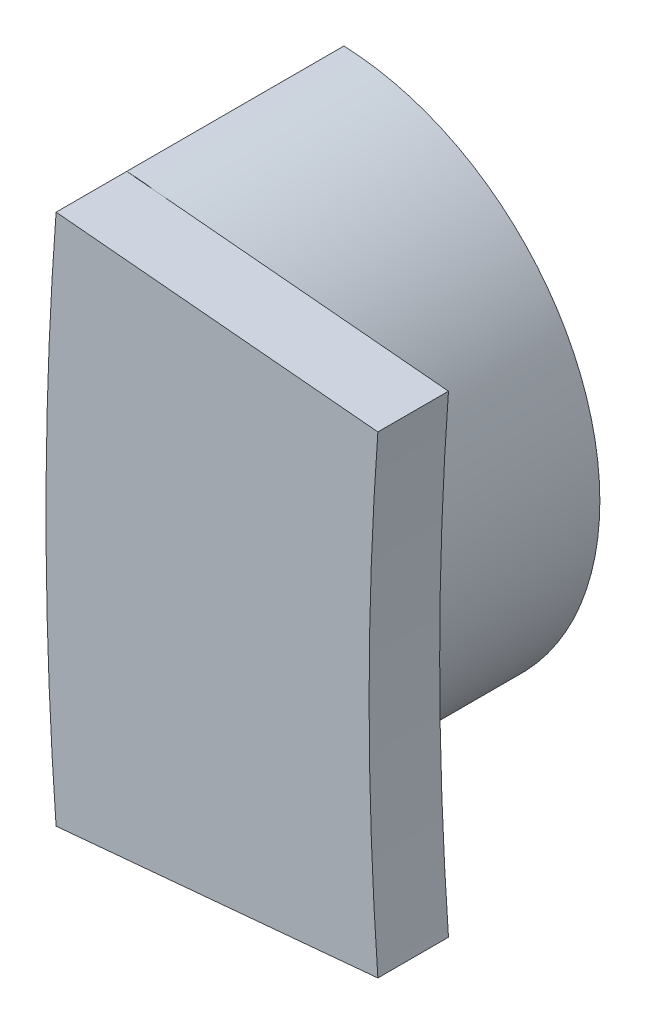
ISO-10303-21;
HEADER;
FILE_DESCRIPTION(('STEP AP214'),'2;1');
FILE_NAME('part.step','',(''),(''),'','','');
FILE_SCHEMA(('AUTOMOTIVE_DESIGN { 1 0 10303 214 1 1 1 1 }'));
ENDSEC;
DATA;
#1=APPLICATION_CONTEXT('core data for automotive mechanical design processes');
#2=APPLICATION_PROTOCOL_DEFINITION('international standard','automotive_design',2000,#1);
#3=PRODUCT_CONTEXT('',#1,'mechanical');
#4=PRODUCT('Part','Part','',(#3));
#5=PRODUCT_RELATED_PRODUCT_CATEGORY('part','',(#4));
#6=PRODUCT_DEFINITION_FORMATION('','',#4);
#7=PRODUCT_DEFINITION_CONTEXT('part definition',#1,'design');
#8=PRODUCT_DEFINITION('design','',#6,#7);
#9=PRODUCT_DEFINITION_SHAPE('','',#8);
#10=(LENGTH_UNIT() NAMED_UNIT(*) SI_UNIT(.MILLI.,.METRE.));
#11=(NAMED_UNIT(*) PLANE_ANGLE_UNIT() SI_UNIT($,.RADIAN.));
#12=(NAMED_UNIT(*) SI_UNIT($,.STERADIAN.) SOLID_ANGLE_UNIT());
#13=UNCERTAINTY_MEASURE_WITH_UNIT(LENGTH_MEASURE(1.E-05),#10,'distance_accuracy_value','');
#14=(GEOMETRIC_REPRESENTATION_CONTEXT(3) GLOBAL_UNCERTAINTY_ASSIGNED_CONTEXT((#13)) GLOBAL_UNIT_ASSIGNED_CONTEXT((#10,
#11,#12)) REPRESENTATION_CONTEXT('',''));
#15=CARTESIAN_POINT('',(0.,0.,0.));
#16=DIRECTION('',(0.,0.,1.));
#17=DIRECTION('',(1.,0.,0.));
#18=AXIS2_PLACEMENT_3D('',#15,#16,#17);
#19=CARTESIAN_POINT('',(-41.0209999996298,0.,5.08));
#20=DIRECTION('',(0.,0.,1.));
#21=DIRECTION('',(1.,0.,0.));
#22=AXIS2_PLACEMENT_3D('',#19,#20,#21);
#23=PLANE('',#22);
#24=DIRECTION('',(-0.995845881254259,0.0910548229855388,0.));
#25=VECTOR('',#24,1.);
#26=CARTESIAN_POINT('',(-81.8059883900929,6.21852293716033,5.08));
#27=LINE('',#26,#25);
#28=CARTESIAN_POINT('',(-81.1463494081902,6.15820907548541,5.08));
#29=VERTEX_POINT('',#28);
#30=CARTESIAN_POINT('',(-81.8059883900929,6.21852293716033,5.08));
#31=VERTEX_POINT('',#30);
#32=EDGE_CURVE('E56',#29,#31,#27,.T.);
#33=ORIENTED_EDGE('',*,*,#32,.F.);
#34=CARTESIAN_POINT('',(-82.042,0.,5.08));
#35=DIRECTION('',(0.,0.,1.));
#36=DIRECTION('',(-1.,0.,0.));
#37=AXIS2_PLACEMENT_3D('',#34,#35,#36);
#38=CIRCLE('',#37,6.22300000000001);
#39=EDGE_CURVE('E116',#29,#31,#38,.T.);
#40=ORIENTED_EDGE('',*,*,#39,.T.);
#41=EDGE_LOOP('',(#33,#40));
#42=FACE_BOUND('',#41,.T.);
#43=ADVANCED_FACE('F33',(#42),#23,.T.);
#44=CARTESIAN_POINT('',(7.40338346183478E-10,0.,5.08));
#45=DIRECTION('',(0.,0.,-1.));
#46=DIRECTION('',(-1.,0.,0.));
#47=AXIS2_PLACEMENT_3D('',#44,#45,#46);
#48=CYLINDRICAL_SURFACE('',#47,82.0420000007382);
#49=CARTESIAN_POINT('',(-82.0419999999979,0.,2.64922));
#50=CARTESIAN_POINT('',(-82.0420000184703,0.017666016010651,2.64921934162447));
#51=CARTESIAN_POINT('',(-82.0419942944228,0.0353339994536826,2.64960660786292));
#52=CARTESIAN_POINT('',(-82.0419716754719,0.0703433347638617,2.65118185721522));
#53=CARTESIAN_POINT('',(-82.041954965437,0.0876852885811285,2.65235659532712));
#54=CARTESIAN_POINT('',(-82.0419109996636,0.122043114910474,2.65550635207967));
#55=CARTESIAN_POINT('',(-82.041883900638,0.139060064847319,2.65746949797516));
#56=CARTESIAN_POINT('',(-82.0418197992292,0.172767096852397,2.66219438330502));
#57=CARTESIAN_POINT('',(-82.0417829243558,0.189458610641181,2.66494587495448));
#58=CARTESIAN_POINT('',(-82.0416998951203,0.222514516863662,2.67124579081534));
#59=CARTESIAN_POINT('',(-82.0416538392637,0.238880509325821,2.67478579850643));
#60=CARTESIAN_POINT('',(-82.041553061846,0.27128521115976,2.68266081513089));
#61=CARTESIAN_POINT('',(-82.0414984106798,0.287325477634632,2.68698940765725));
#62=CARTESIAN_POINT('',(-82.0413810430945,0.319078813043122,2.69643952573307));
#63=CARTESIAN_POINT('',(-82.0413183707385,0.334793161581902,2.70155674828186));
#64=CARTESIAN_POINT('',(-82.04118554765,0.365894980386381,2.71258195819879));
#65=CARTESIAN_POINT('',(-82.0411154172616,0.381283209211439,2.71848780507907));
#66=CARTESIAN_POINT('',(-82.0409682504134,0.41173335601415,2.73108806979321));
#67=CARTESIAN_POINT('',(-82.0408912139409,0.426795273386686,2.73778248908928));
#68=CARTESIAN_POINT('',(-82.0407307919902,0.456593600799065,2.75195774938994));
#69=CARTESIAN_POINT('',(-82.0406473900984,0.471329033619345,2.75944064378513));
#70=CARTESIAN_POINT('',(-82.0404747785809,0.500475407467583,2.77519082010412));
#71=CARTESIAN_POINT('',(-82.0403855404854,0.51488421170194,2.78346205358743));
#72=CARTESIAN_POINT('',(-82.0402017817508,0.543378516255494,2.8007870499236));
#73=CARTESIAN_POINT('',(-82.0401072250853,0.55746058258278,2.80984645561173));
#74=CARTESIAN_POINT('',(-82.0399133381632,0.585302727709975,2.82874616731836));
#75=CARTESIAN_POINT('',(-82.0398139687412,0.59905798979236,2.83859356159248));
#76=CARTESIAN_POINT('',(-82.0396109495037,0.626247901107876,2.8590678714826));
#77=CARTESIAN_POINT('',(-82.0395072615111,0.639676319325833,2.86970305167153));
#78=CARTESIAN_POINT('',(-82.0392960817323,0.666213984501214,2.89175187222689));
#79=CARTESIAN_POINT('',(-82.039188556404,0.67931560721216,2.90317467778279));
#80=CARTESIAN_POINT('',(-82.0389701670818,0.705200899590948,2.92679781642838));
#81=CARTESIAN_POINT('',(-82.0388592773168,0.717975614933986,2.93900794359062));
#82=CARTESIAN_POINT('',(-82.0386365575508,0.742988641089158,2.9639856324596));
#83=CARTESIAN_POINT('',(-82.0385247268603,0.755226508522254,2.97675363816931));
#84=CARTESIAN_POINT('',(-82.0383033103829,0.778904278573242,3.0026268602913));
#85=CARTESIAN_POINT('',(-82.0381937179144,0.790353992060458,3.01572308229566));
#86=CARTESIAN_POINT('',(-82.0379777908823,0.812455741127486,3.04225133707883));
#87=CARTESIAN_POINT('',(-82.037871432117,0.823116960312706,3.05567570926292));
#88=CARTESIAN_POINT('',(-82.0376629079712,0.843642479227437,3.08285890200632));
#89=CARTESIAN_POINT('',(-82.0375607068293,0.853515061765278,3.09661146064525));
#90=CARTESIAN_POINT('',(-82.0373613601932,0.872464285830176,3.12444956987893));
#91=CARTESIAN_POINT('',(-82.0372641736946,0.881548032782525,3.13853027870928));
#92=CARTESIAN_POINT('',(-82.0370756437653,0.898920857060205,3.16702323256388));
#93=CARTESIAN_POINT('',(-82.0369842605921,0.907215592112899,3.1814320248327));
#94=CARTESIAN_POINT('',(-82.0368080501555,0.923011926497248,3.2105797335644));
#95=CARTESIAN_POINT('',(-82.0367231907728,0.93051748884223,3.22531650083216));
#96=CARTESIAN_POINT('',(-82.0365606663543,0.944737250519795,3.25511885064117));
#97=CARTESIAN_POINT('',(-82.0364829827064,0.951453510180065,3.27018344970331));
#98=CARTESIAN_POINT('',(-82.0363353744196,0.964096632250191,3.30064030914226));
#99=CARTESIAN_POINT('',(-82.0362654497512,0.970023497652457,3.31603256827674));
#100=CARTESIAN_POINT('',(-82.0361338512348,0.98108993235574,3.34714379329947));
#101=CARTESIAN_POINT('',(-82.0360721999219,0.986227356665532,3.3628635219615));
#102=CARTESIAN_POINT('',(-82.0359575682751,0.995717078284553,3.39462896312444));
#103=CARTESIAN_POINT('',(-82.035904635722,1.0000650617496,3.41067596335777));
#104=CARTESIAN_POINT('',(-82.0358077914701,1.00797806737864,3.44309547180042));
#105=CARTESIAN_POINT('',(-82.0357639540717,1.01153665593779,3.45946954806141));
#106=CARTESIAN_POINT('',(-82.0356855811586,1.01787296464649,3.49254298631075));
#107=CARTESIAN_POINT('',(-82.0356511463322,1.02064224521564,3.50924396133933));
#108=CARTESIAN_POINT('',(-82.0355917921405,1.02540189510842,3.54297119362428));
#109=CARTESIAN_POINT('',(-82.0355669984178,1.02738198752727,3.55999889539073));
#110=CARTESIAN_POINT('',(-82.0355270738102,1.03056503345604,3.59437985031052));
#111=CARTESIAN_POINT('',(-82.035512090971,1.03175608336157,3.61173419863703));
#112=CARTESIAN_POINT('',(-82.0354918703505,1.03336258697337,3.64676864922359));
#113=CARTESIAN_POINT('',(-82.0354867995856,1.033764748471,3.66444934925843));
#114=CARTESIAN_POINT('',(-82.0354864243432,1.03379452552585,3.69981797311467));
#115=CARTESIAN_POINT('',(-82.0354911234957,1.03342185319836,3.7175058971789));
#116=CARTESIAN_POINT('',(-82.0355106166977,1.03187327534074,3.75255581202836));
#117=CARTESIAN_POINT('',(-82.0355252434598,1.03071068022822,3.76991837915391));
#118=CARTESIAN_POINT('',(-82.0355644744538,1.02758346186429,3.80431678569158));
#119=CARTESIAN_POINT('',(-82.0355889303422,1.02563076025212,3.82135370200951));
#120=CARTESIAN_POINT('',(-82.0356476294592,1.02092481855931,3.85510037386146));
#121=CARTESIAN_POINT('',(-82.0356817467497,1.01818187196035,3.87181155901399));
#122=CARTESIAN_POINT('',(-82.0357595071579,1.01189715734677,3.90490642453466));
#123=CARTESIAN_POINT('',(-82.0358030493146,1.00836384343024,3.92129170648481));
#124=CARTESIAN_POINT('',(-82.0358993273847,1.0005003161058,3.95373462978883));
#125=CARTESIAN_POINT('',(-82.0359519887693,0.996176548018359,3.96979383108296));
#126=CARTESIAN_POINT('',(-82.036066103921,0.986734189068285,4.00158467446044));
#127=CARTESIAN_POINT('',(-82.0361275097416,0.981619920327398,4.01731759927534));
#128=CARTESIAN_POINT('',(-82.0362586444527,0.970598732357865,4.04845621358206));
#129=CARTESIAN_POINT('',(-82.0363283507201,0.964693962437664,4.0638626635871));
#130=CARTESIAN_POINT('',(-82.0364755505259,0.952093971040911,4.0943488990513));
#131=CARTESIAN_POINT('',(-82.0365530440937,0.945398746569478,4.10942868327254));
#132=CARTESIAN_POINT('',(-82.036715217623,0.931219999384277,4.13926239548158));
#133=CARTESIAN_POINT('',(-82.0367999162899,0.923734411848001,4.15401534171916));
#134=CARTESIAN_POINT('',(-82.0369758353295,0.907976975767756,4.18319639890949));
#135=CARTESIAN_POINT('',(-82.0370670880078,0.899701155244563,4.19762236356008));
#136=CARTESIAN_POINT('',(-82.0372553875666,0.882365112940117,4.22615065143134));
#137=CARTESIAN_POINT('',(-82.0373524744642,0.873299220195117,4.24024952541397));
#138=CARTESIAN_POINT('',(-82.0375516529181,0.854384662373689,4.26812495451944));
#139=CARTESIAN_POINT('',(-82.0376537858322,0.844528874729288,4.28189667155086));
#140=CARTESIAN_POINT('',(-82.037862204802,0.824035904318494,4.30911916748012));
#141=CARTESIAN_POINT('',(-82.0379685270392,0.813390418121904,4.3225636878453));
#142=CARTESIAN_POINT('',(-82.0381844122654,0.791319107873725,4.34913323760672));
#143=CARTESIAN_POINT('',(-82.0382939999265,0.779884076846419,4.36225060942161));
#144=CARTESIAN_POINT('',(-82.0385154382997,0.756234605716559,4.38816708506172));
#145=CARTESIAN_POINT('',(-82.0386272962057,0.744010328360298,4.40095719600206));
#146=CARTESIAN_POINT('',(-82.0388502763936,0.719003482995452,4.42599966224629));
#147=CARTESIAN_POINT('',(-82.0389613980252,0.70622048194356,4.43825158513133));
#148=CARTESIAN_POINT('',(-82.039180261406,0.680316800292215,4.4619556001036));
#149=CARTESIAN_POINT('',(-82.0392880286785,0.667205149810224,4.47341754246227));
#150=CARTESIAN_POINT('',(-82.039499700022,0.640645574370166,4.49554187613283));
#151=CARTESIAN_POINT('',(-82.0396036375106,0.627205340577731,4.5062134890445));
#152=CARTESIAN_POINT('',(-82.0398071601547,0.599989965588686,4.52675791657384));
#153=CARTESIAN_POINT('',(-82.0399067834753,0.58622111122845,4.53663904909329));
#154=CARTESIAN_POINT('',(-82.0401011793725,0.558349957510586,4.55560349010578));
#155=CARTESIAN_POINT('',(-82.040195991186,0.544252518899619,4.56469393462435));
#156=CARTESIAN_POINT('',(-82.0403802580276,0.515725658951389,4.58207826863155));
#157=CARTESIAN_POINT('',(-82.0404697492017,0.501299703478465,4.59037784035465));
#158=CARTESIAN_POINT('',(-82.0406428612419,0.472117228658336,4.60618196213785));
#159=CARTESIAN_POINT('',(-82.0407265107032,0.457362866161415,4.61369049214642));
#160=CARTESIAN_POINT('',(-82.0408874186278,0.427524892973392,4.62791430449189));
#161=CARTESIAN_POINT('',(-82.0409646935905,0.412442268735288,4.63463165529156));
#162=CARTESIAN_POINT('',(-82.0411123246442,0.381948932568304,4.64727507776812));
#163=CARTESIAN_POINT('',(-82.041182680748,0.366538221247927,4.65320115091245));
#164=CARTESIAN_POINT('',(-82.041315938802,0.335389670823069,4.66426412362004));
#165=CARTESIAN_POINT('',(-82.0413788202791,0.319651065989609,4.66939886660013));
#166=CARTESIAN_POINT('',(-82.0414965858669,0.28784745814609,4.67888135208309));
#167=CARTESIAN_POINT('',(-82.0415514256185,0.271781163523296,4.6832247591614));
#168=CARTESIAN_POINT('',(-82.041652556102,0.239322649824505,4.69112674768546));
#169=CARTESIAN_POINT('',(-82.0416987759472,0.222928859202399,4.69467886455139));
#170=CARTESIAN_POINT('',(-82.0417821050856,0.189815603130675,4.70100035691184));
#171=CARTESIAN_POINT('',(-82.0418191151658,0.173094523046731,4.70376125326788));
#172=CARTESIAN_POINT('',(-82.0418834548474,0.139326603878404,4.70850232018005));
#173=CARTESIAN_POINT('',(-82.0419106560063,0.122278320261304,4.71047216777404));
#174=CARTESIAN_POINT('',(-82.0419547896677,0.087856072224001,4.71363271128817));
#175=CARTESIAN_POINT('',(-82.041971564298,0.0704810209836749,4.71481144897177));
#176=CARTESIAN_POINT('',(-82.0419942718882,0.0354037230491259,4.71639209267559));
#177=CARTESIAN_POINT('',(-82.0420000186052,0.0177008692472679,4.71678066045052));
#178=CARTESIAN_POINT('',(-82.0419999999979,0.,4.71678));
#179=B_SPLINE_CURVE_WITH_KNOTS('',3,(#49,#50,#51,#52,#53,#54,#55,#56,#57,#58,#59,#60,#61,#62,
#63,#64,#65,#66,#67,#68,#69,#70,#71,#72,#73,#74,#75,#76,#77,#78,#79,#80,#81,#82,#83,#84,#85,#86,
#87,#88,#89,#90,#91,#92,#93,#94,#95,#96,#97,#98,#99,#100,#101,#102,#103,#104,#105,#106,#107,
#108,#109,#110,#111,#112,#113,#114,#115,#116,#117,#118,#119,#120,#121,#122,#123,#124,#125,#126,
#127,#128,#129,#130,#131,#132,#133,#134,#135,#136,#137,#138,#139,#140,#141,#142,#143,#144,#145,
#146,#147,#148,#149,#150,#151,#152,#153,#154,#155,#156,#157,#158,#159,#160,#161,#162,#163,#164,
#165,#166,#167,#168,#169,#170,#171,#172,#173,#174,#175,#176,#177,#178),.UNSPECIFIED.,.F.,.F.,(4,
2,2,2,2,2,2,2,2,2,2,2,2,2,2,2,2,2,2,2,2,2,2,2,2,2,2,2,2,2,2,2,2,2,2,2,2,2,2,2,2,2,2,2,2,2,2,2,2,
2,2,2,2,2,2,2,2,2,2,2,2,2,2,2,4),(0.,0.0529966492727824,0.105123561515776,0.15649327854614,
0.20722338181362,0.257435946269652,0.307256851349344,0.356814961065796,0.406241194954181,
0.455667520491657,0.505225904423363,0.555047264117367,0.605260460068822,0.655991366976093,
0.707362054003771,0.759490095956781,0.812488027351534,0.865528935575138,0.917697864642035,
0.969107586984047,1.01987593459555,1.07012525164429,1.11998170343727,1.16957445375284,
1.21903473235488,1.26849482345928,1.31808701278308,1.36794253453418,1.41819055970486,
1.46895726331467,1.52036500139636,1.57253161956724,1.62556990522541,1.67862790045132,
1.73081332683325,1.78223908032133,1.83302312351237,1.88328793714653,1.9331598276493,
1.98276810277265,2.03224413722168,2.08172035913199,2.13132919513718,2.18120201549589,
2.23146812074239,2.28225380758472,2.33368154489257,2.38586928163413,2.43892989878771,
2.49203239670137,2.54426022600336,2.59572649678448,2.64654940410207,2.69685167834367,
2.74675989094538,2.79640362752777,2.84591455040502,2.89542538146219,2.94506884332065,
2.99497660047428,3.04527824208167,3.09610034434197,3.14756564346057,3.19979234117366,
3.25289355490823),.UNSPECIFIED.);
#180=CARTESIAN_POINT('',(-82.0419999999979,0.,2.64922));
#181=VERTEX_POINT('',#180);
#182=CARTESIAN_POINT('',(-82.0419999999979,0.,4.71678));
#183=VERTEX_POINT('',#182);
#184=EDGE_CURVE('E44',#181,#183,#179,.T.);
#185=ORIENTED_EDGE('',*,*,#184,.T.);
#186=CARTESIAN_POINT('',(-82.0419999999979,0.,4.71678));
#187=CARTESIAN_POINT('',(-82.0420000185544,-0.0176877709544173,4.71678065967281));
#188=CARTESIAN_POINT('',(-82.0419942803622,-0.0353775200162267,4.71639258114873));
#189=CARTESIAN_POINT('',(-82.0419716061038,-0.0704292773555671,4.71481396528474));
#190=CARTESIAN_POINT('',(-82.041954855763,-0.0877918907988414,4.71363673109781));
#191=CARTESIAN_POINT('',(-82.0419107852303,-0.122189930260955,4.71048024253676));
#192=CARTESIAN_POINT('',(-82.0418836224741,-0.139226439562171,4.70851291422193));
#193=CARTESIAN_POINT('',(-82.0418193723818,-0.172971479775946,4.70377793028092));
#194=CARTESIAN_POINT('',(-82.041782413137,-0.189681450396415,4.70102056931983));
#195=CARTESIAN_POINT('',(-82.0416991967532,-0.222773158176852,4.69470718798595));
#196=CARTESIAN_POINT('',(-82.0416530385608,-0.239156504470427,4.6911596231807));
#197=CARTESIAN_POINT('',(-82.0415520408104,-0.271594800793636,4.68326777392033));
#198=CARTESIAN_POINT('',(-82.041497271954,-0.287651316929632,4.67892993591105));
#199=CARTESIAN_POINT('',(-82.0413796559817,-0.319436038857523,4.66945961796942));
#200=CARTESIAN_POINT('',(-82.0413168531136,-0.33516553173946,4.66433146125594));
#201=CARTESIAN_POINT('',(-82.0411837585565,-0.366296528230702,4.65328268432096));
#202=CARTESIAN_POINT('',(-82.0411134872922,-0.381698794868441,4.64736421462374));
#203=CARTESIAN_POINT('',(-82.0409660307106,-0.412175909625204,4.63473701599449));
#204=CARTESIAN_POINT('',(-82.0408888453805,-0.427250757136998,4.62802828559699));
#205=CARTESIAN_POINT('',(-82.0407281200911,-0.457073841945648,4.61382272491884));
#206=CARTESIAN_POINT('',(-82.0406445636648,-0.471821096267427,4.60632383184869));
#207=CARTESIAN_POINT('',(-82.0404716397067,-0.500990016175987,4.59053998920845));
#208=CARTESIAN_POINT('',(-82.0403822436268,-0.515409532466795,4.58225107037472));
#209=CARTESIAN_POINT('',(-82.0401981676926,-0.543924171339907,4.56488904260099));
#210=CARTESIAN_POINT('',(-82.0401034517372,-0.558015840062844,4.55581026625453));
#211=CARTESIAN_POINT('',(-82.0399092470483,-0.585876106711106,4.53687015807942));
#212=CARTESIAN_POINT('',(-82.0398097191047,-0.599639860468411,4.52700170819752));
#213=CARTESIAN_POINT('',(-82.0396063855382,-0.626845682791321,4.50648363989257));
#214=CARTESIAN_POINT('',(-82.0395025417453,-0.640281485557038,4.49582572364576));
#215=CARTESIAN_POINT('',(-82.0392910550264,-0.666832841716772,4.47372977437429));
#216=CARTESIAN_POINT('',(-82.0391833786363,-0.679940729075861,4.46228254090688));
#217=CARTESIAN_POINT('',(-82.0389646931515,-0.705837528698881,4.43860893823874));
#218=CARTESIAN_POINT('',(-82.0388536584373,-0.718617439674236,4.42637274017256));
#219=CARTESIAN_POINT('',(-82.0386308636772,-0.743616773595364,4.40136439747226));
#220=CARTESIAN_POINT('',(-82.0385191044418,-0.755836729619645,4.3885927857133));
#221=CARTESIAN_POINT('',(-82.0382978469217,-0.779479245518505,4.36271321879255));
#222=CARTESIAN_POINT('',(-82.0381883416493,-0.790911605355295,4.34961423253147));
#223=CARTESIAN_POINT('',(-82.0379726022886,-0.812979264921471,4.32308136538338));
#224=CARTESIAN_POINT('',(-82.037866343788,-0.823623736076015,4.30965512176259));
#225=CARTESIAN_POINT('',(-82.0376580313352,-0.844116364495442,4.2824690856098));
#226=CARTESIAN_POINT('',(-82.0375559414868,-0.853972792702111,4.26871553535732));
#227=CARTESIAN_POINT('',(-82.03735682646,-0.872890316638741,4.24087634214875));
#228=CARTESIAN_POINT('',(-82.037259760206,-0.881958506764832,4.22679552516031));
#229=CARTESIAN_POINT('',(-82.0370714778023,-0.899300823963249,4.19830324922913));
#230=CARTESIAN_POINT('',(-82.0369802218848,-0.907580599408517,4.18389523136082));
#231=CARTESIAN_POINT('',(-82.0368042711215,-0.923347619481525,4.15474996165272));
#232=CARTESIAN_POINT('',(-82.0367195441585,-0.930838820215782,4.14001485145951));
#233=CARTESIAN_POINT('',(-82.0365572879915,-0.945030460839877,4.11021670173098));
#234=CARTESIAN_POINT('',(-82.0364797401856,-0.951732957312263,4.09515464208377));
#235=CARTESIAN_POINT('',(-82.0363324053666,-0.964349151833262,4.06470374344241));
#236=CARTESIAN_POINT('',(-82.0362626183242,-0.970262852869758,4.0493149056863));
#237=CARTESIAN_POINT('',(-82.0361312953364,-0.981303553766173,4.01821140184182));
#238=CARTESIAN_POINT('',(-82.0360697819002,-0.986428412766611,4.00249597603062));
#239=CARTESIAN_POINT('',(-82.0359554248939,-0.99589359449584,3.9707400160417));
#240=CARTESIAN_POINT('',(-82.0359026290396,-1.00022961182903,3.95469819959445));
#241=CARTESIAN_POINT('',(-82.0358060557989,-1.00811927149601,3.92228993193658));
#242=CARTESIAN_POINT('',(-82.0357623526003,-1.01166649294678,3.90592191985261));
#243=CARTESIAN_POINT('',(-82.035684244531,-1.01798064988782,3.87286148162596));
#244=CARTESIAN_POINT('',(-82.035649940184,-1.02073916254678,3.85616745064598));
#245=CARTESIAN_POINT('',(-82.0355908423539,-1.02547785379293,3.8224549773122));
#246=CARTESIAN_POINT('',(-82.035566174296,-1.02744777580916,3.80543509904206));
#247=CARTESIAN_POINT('',(-82.0355264953994,-1.03061105990794,3.77107066166361));
#248=CARTESIAN_POINT('',(-82.0355116323379,-1.03179254185007,3.75372501582655));
#249=CARTESIAN_POINT('',(-82.0354916450461,-1.03338046571286,3.71870884141501));
#250=CARTESIAN_POINT('',(-82.0354866875235,-1.03377364100032,3.70103772294037));
#251=CARTESIAN_POINT('',(-82.0354865288224,-1.03378623473488,3.66567936234238));
#252=CARTESIAN_POINT('',(-82.0354913363962,-1.03340495906154,3.64799211996934));
#253=CARTESIAN_POINT('',(-82.0355110429962,-1.03183938965724,3.61294393477151));
#254=CARTESIAN_POINT('',(-82.035525774771,-1.03066840445712,3.59558240918699));
#255=CARTESIAN_POINT('',(-82.0355652118887,-1.02752460065345,3.56118645050002));
#256=CARTESIAN_POINT('',(-82.0355897689305,-1.02556370199932,3.54415093482597));
#257=CARTESIAN_POINT('',(-82.0356486657103,-1.02084156643903,3.51040742845992));
#258=CARTESIAN_POINT('',(-82.0356828795592,-1.01809062122534,3.49369800332151));
#259=CARTESIAN_POINT('',(-82.0357608278212,-1.01179010818201,3.4606070210865));
#260=CARTESIAN_POINT('',(-82.0358044613226,-1.00824899277471,3.44422385850213));
#261=CARTESIAN_POINT('',(-82.0359009162179,-1.00037006150603,3.41178553624276));
#262=CARTESIAN_POINT('',(-82.0359536631274,-0.996038689513343,3.39572881369721));
#263=CARTESIAN_POINT('',(-82.0360679429087,-0.986581321427845,3.36394328912088));
#264=CARTESIAN_POINT('',(-82.0361294278682,-0.981459646366651,3.34821320242701));
#265=CARTESIAN_POINT('',(-82.0362607139187,-0.970423844060393,3.31708062464866));
#266=CARTESIAN_POINT('',(-82.0363304924059,-0.96451186552202,3.30167737210779));
#267=CARTESIAN_POINT('',(-82.036477829234,-0.951897654663458,3.27119789086289));
#268=CARTESIAN_POINT('',(-82.0365553876043,-0.945195419348461,3.25612166339844));
#269=CARTESIAN_POINT('',(-82.0367176828806,-0.931002847629621,3.22629542304657));
#270=CARTESIAN_POINT('',(-82.0368024384693,-0.923510447096811,3.21154639278223));
#271=CARTESIAN_POINT('',(-82.0369784630909,-0.907739581444222,3.18237352504741));
#272=CARTESIAN_POINT('',(-82.0370697643821,-0.899457145796576,3.16795183552508));
#273=CARTESIAN_POINT('',(-82.0372581525365,-0.88210806897595,3.13943245458543));
#274=CARTESIAN_POINT('',(-82.0373552793437,-0.873035759083356,3.12533821470889));
#275=CARTESIAN_POINT('',(-82.0375545286561,-0.85410856161488,3.09747241018277));
#276=CARTESIAN_POINT('',(-82.0376566924206,-0.844246554508294,3.08370568646263));
#277=CARTESIAN_POINT('',(-82.037865163821,-0.823741340155583,3.05649353181698));
#278=CARTESIAN_POINT('',(-82.0379715075153,-0.813089833301781,3.04305436265239));
#279=CARTESIAN_POINT('',(-82.0381874261563,-0.791006671720365,3.01649587418326));
#280=CARTESIAN_POINT('',(-82.03829702563,-0.779565814501617,3.003384216037));
#281=CARTESIAN_POINT('',(-82.0385184777513,-0.755904896497278,2.97747950883608));
#282=CARTESIAN_POINT('',(-82.0386303374257,-0.743675003864079,2.96469545612583));
#283=CARTESIAN_POINT('',(-82.0388532425262,-0.718664925610221,2.939673166174));
#284=CARTESIAN_POINT('',(-82.0389642878124,-0.70588464789745,2.92743502097821));
#285=CARTESIAN_POINT('',(-82.0391829951019,-0.679987010508945,2.90375766827541));
#286=CARTESIAN_POINT('',(-82.0392906827103,-0.666878655957029,2.89230862900049));
#287=CARTESIAN_POINT('',(-82.039502192174,-0.640326284896322,2.87020919087952));
#288=CARTESIAN_POINT('',(-82.0396060474885,-0.626889937443212,2.8595495890518));
#289=CARTESIAN_POINT('',(-82.0398094043155,-0.599682939603939,2.83902827791504));
#290=CARTESIAN_POINT('',(-82.0399089439974,-0.585918557617937,2.82915826829969));
#291=CARTESIAN_POINT('',(-82.0401031722148,-0.558056950505645,2.81021516734863));
#292=CARTESIAN_POINT('',(-82.0401978999638,-0.543964571581298,2.80113495575323));
#293=CARTESIAN_POINT('',(-82.0403819993857,-0.515448428452222,2.78377018426295));
#294=CARTESIAN_POINT('',(-82.0404714071652,-0.501028119582649,2.77547995513821));
#295=CARTESIAN_POINT('',(-82.0406443542624,-0.471857531354794,2.75969361817068));
#296=CARTESIAN_POINT('',(-82.0407279221341,-0.457109402220593,2.75219353975096));
#297=CARTESIAN_POINT('',(-82.0408886698909,-0.42728448515202,2.73798573411052));
#298=CARTESIAN_POINT('',(-82.0409658662471,-0.412208680620079,2.73127594340295));
#299=CARTESIAN_POINT('',(-82.0411133442909,-0.381729569695865,2.71864674923777));
#300=CARTESIAN_POINT('',(-82.0411836259913,-0.366326263910981,2.71272734431444));
#301=CARTESIAN_POINT('',(-82.0413167406595,-0.335193107412667,2.70167682129605));
#302=CARTESIAN_POINT('',(-82.0413795531967,-0.319462493338981,2.69654785446998));
#303=CARTESIAN_POINT('',(-82.0414971875719,-0.287675447629368,2.6870760399181));
#304=CARTESIAN_POINT('',(-82.0415519651483,-0.271617728347678,2.68273751691137));
#305=CARTESIAN_POINT('',(-82.0416529792244,-0.239176944532689,2.67484442051921));
#306=CARTESIAN_POINT('',(-82.0416991449996,-0.222792313224608,2.67129629580849));
#307=CARTESIAN_POINT('',(-82.0417823752513,-0.189697954309102,2.66498191681642));
#308=CARTESIAN_POINT('',(-82.0418193407482,-0.172986616892137,2.66222412099977));
#309=CARTESIAN_POINT('',(-82.0418836018589,-0.139238761931034,2.65748838885181));
#310=CARTESIAN_POINT('',(-82.0419107693381,-0.122200804086083,2.65552075066376));
#311=CARTESIAN_POINT('',(-82.0419548476346,-0.0877997863925629,2.65236376334246));
#312=CARTESIAN_POINT('',(-82.0419716009625,-0.0704356428268521,2.65118634422377));
#313=CARTESIAN_POINT('',(-82.0419942793201,-0.0353807434771228,2.64960747893486));
#314=CARTESIAN_POINT('',(-82.0420000185606,-0.0176893822887079,2.64921934023138));
#315=CARTESIAN_POINT('',(-82.0419999999979,0.,2.64922));
#316=B_SPLINE_CURVE_WITH_KNOTS('',3,(#186,#187,#188,#189,#190,#191,#192,#193,#194,#195,#196,
#197,#198,#199,#200,#201,#202,#203,#204,#205,#206,#207,#208,#209,#210,#211,#212,#213,#214,#215,
#216,#217,#218,#219,#220,#221,#222,#223,#224,#225,#226,#227,#228,#229,#230,#231,#232,#233,#234,
#235,#236,#237,#238,#239,#240,#241,#242,#243,#244,#245,#246,#247,#248,#249,#250,#251,#252,#253,
#254,#255,#256,#257,#258,#259,#260,#261,#262,#263,#264,#265,#266,#267,#268,#269,#270,#271,#272,
#273,#274,#275,#276,#277,#278,#279,#280,#281,#282,#283,#284,#285,#286,#287,#288,#289,#290,#291,
#292,#293,#294,#295,#296,#297,#298,#299,#300,#301,#302,#303,#304,#305,#306,#307,#308,#309,#310,
#311,#312,#313,#314,#315),.UNSPECIFIED.,.F.,.F.,(4,2,2,2,2,2,2,2,2,2,2,2,2,2,2,2,2,2,2,2,2,2,2,
2,2,2,2,2,2,2,2,2,2,2,2,2,2,2,2,2,2,2,2,2,2,2,2,2,2,2,2,2,2,2,2,2,2,2,2,2,2,2,2,2,4),(0.,
0.0530619170562973,0.105251115903248,0.156680497474213,0.207468030187763,0.25773620150333,
0.307611325498959,0.357222718522183,0.406701764791877,0.456180902817527,0.505792570374182,
0.555668149505698,0.605936953028915,0.656725290268998,0.708155642879027,0.760345972611641,
0.813409173077017,0.866420760606336,0.918561708069615,0.969944626630003,1.02068717450432,
1.07091151061194,1.12074360506835,1.17031241851267,1.21974897201952,1.26918533826007,
1.31875359140301,1.36858475695667,1.41880780275734,1.46954870861117,1.5209296452764,
1.57306828456342,1.62607725257079,1.67913375211537,1.73131775135295,1.7827421379855,
1.83352486572063,1.88378840582145,1.93365905472667,1.98326610979407,2.03274093505009,
2.08221594780513,2.13182356386745,2.18169514281634,2.2319599747909,2.28274434651077,
2.33417071736702,2.38635702743631,2.43941614944661,2.49248418423024,2.54467912722581,
2.5961138986633,2.64690648898313,2.69717941042149,2.74705900453094,2.79667461766906,
2.84615766633831,2.8956406232436,2.94525596182487,2.99513510075997,3.04540738993812,
3.09619917566591,3.14763297598756,3.19982678801067,3.25289353929033),.UNSPECIFIED.);
#317=EDGE_CURVE('E11',#183,#181,#316,.T.);
#318=ORIENTED_EDGE('',*,*,#317,.T.);
#319=EDGE_LOOP('',(#185,#318));
#320=FACE_BOUND('',#319,.T.);
#321=CARTESIAN_POINT('',(7.40338346183478E-10,0.,0.));
#322=DIRECTION('',(0.,0.,1.));
#323=DIRECTION('',(1.,0.,0.));
#324=AXIS2_PLACEMENT_3D('',#321,#322,#323);
#325=CIRCLE('',#324,82.0420000007382);
#326=CARTESIAN_POINT('',(-81.8059883900929,6.21852293716033,0.));
#327=VERTEX_POINT('',#326);
#328=CARTESIAN_POINT('',(-81.8059883900929,-6.21852293716033,0.));
#329=VERTEX_POINT('',#328);
#330=EDGE_CURVE('E117',#327,#329,#325,.T.);
#331=ORIENTED_EDGE('',*,*,#330,.T.);
#332=DIRECTION('',(0.,0.,-1.));
#333=VECTOR('',#332,1.);
#334=CARTESIAN_POINT('',(-81.8059883900929,-6.21852293716033,5.08));
#335=LINE('',#334,#333);
#336=CARTESIAN_POINT('',(-81.8059883900929,-6.21852293716033,5.08));
#337=VERTEX_POINT('',#336);
#338=EDGE_CURVE('E107',#337,#329,#335,.T.);
#339=ORIENTED_EDGE('',*,*,#338,.F.);
#340=DIRECTION('',(0.,0.,-1.));
#341=VECTOR('',#340,1.);
#342=CARTESIAN_POINT('',(-81.8059883900929,-6.21852293716033,6.731));
#343=LINE('',#342,#341);
#344=CARTESIAN_POINT('',(-81.8059883900929,-6.21852293716033,6.731));
#345=VERTEX_POINT('',#344);
#346=EDGE_CURVE('E120',#345,#337,#343,.T.);
#347=ORIENTED_EDGE('',*,*,#346,.F.);
#348=CARTESIAN_POINT('',(-4.00457444982294E-10,0.,6.731));
#349=DIRECTION('',(0.,0.,1.));
#350=DIRECTION('',(1.,0.,0.));
#351=AXIS2_PLACEMENT_3D('',#348,#349,#350);
#352=CIRCLE('',#351,82.0419999996007);
#353=CARTESIAN_POINT('',(-81.8059883900929,6.21852293716033,6.731));
#354=VERTEX_POINT('',#353);
#355=EDGE_CURVE('E138',#354,#345,#352,.T.);
#356=ORIENTED_EDGE('',*,*,#355,.F.);
#357=DIRECTION('',(0.,0.,-1.));
#358=VECTOR('',#357,1.);
#359=CARTESIAN_POINT('',(-81.8059883900929,6.21852293716033,6.731));
#360=LINE('',#359,#358);
#361=EDGE_CURVE('E131',#354,#31,#360,.T.);
#362=ORIENTED_EDGE('',*,*,#361,.T.);
#363=DIRECTION('',(0.,0.,-1.));
#364=VECTOR('',#363,1.);
#365=CARTESIAN_POINT('',(-81.8059883900929,6.21852293716033,5.08));
#366=LINE('',#365,#364);
#367=EDGE_CURVE('E110',#31,#327,#366,.T.);
#368=ORIENTED_EDGE('',*,*,#367,.T.);
#369=EDGE_LOOP('',(#331,#339,#347,#356,#362,#368));
#370=FACE_BOUND('',#369,.T.);
#371=ADVANCED_FACE('F35',(#320,#370),#48,.T.);
#372=CARTESIAN_POINT('',(-82.042,0.,5.08));
#373=DIRECTION('',(0.,0.,-1.));
#374=DIRECTION('',(-1.,0.,0.));
#375=AXIS2_PLACEMENT_3D('',#372,#373,#374);
#376=CYLINDRICAL_SURFACE('',#375,6.22300000000001);
#377=CARTESIAN_POINT('',(-82.042,0.,0.));
#378=DIRECTION('',(0.,0.,1.));
#379=DIRECTION('',(-1.,0.,0.));
#380=AXIS2_PLACEMENT_3D('',#377,#378,#379);
#381=CIRCLE('',#380,6.22300000000001);
#382=EDGE_CURVE('E114',#329,#327,#381,.T.);
#383=ORIENTED_EDGE('',*,*,#382,.T.);
#384=ORIENTED_EDGE('',*,*,#367,.F.);
#385=ORIENTED_EDGE('',*,*,#39,.F.);
#386=CARTESIAN_POINT('',(-81.1463494081902,-6.15820907548541,5.08));
#387=VERTEX_POINT('',#386);
#388=EDGE_CURVE('E122',#387,#29,#38,.T.);
#389=ORIENTED_EDGE('',*,*,#388,.F.);
#390=EDGE_CURVE('E113',#337,#387,#38,.T.);
#391=ORIENTED_EDGE('',*,*,#390,.F.);
#392=ORIENTED_EDGE('',*,*,#338,.T.);
#393=EDGE_LOOP('',(#383,#384,#385,#389,#391,#392));
#394=FACE_BOUND('',#393,.T.);
#395=ADVANCED_FACE('F198',(#394),#376,.T.);
#396=DIRECTION('',(0.995845881254259,0.0910548229855388,0.));
#397=VECTOR('',#396,1.);
#398=CARTESIAN_POINT('',(-81.8059883900929,-6.21852293716033,5.08));
#399=LINE('',#398,#397);
#400=EDGE_CURVE('E141',#337,#387,#399,.T.);
#401=ORIENTED_EDGE('',*,*,#400,.F.);
#402=ORIENTED_EDGE('',*,*,#390,.T.);
#403=EDGE_LOOP('',(#401,#402));
#404=FACE_BOUND('',#403,.T.);
#405=ADVANCED_FACE('F195',(#404),#23,.T.);
#406=CARTESIAN_POINT('',(-41.0209999996298,0.,0.));
#407=DIRECTION('',(0.,0.,1.));
#408=DIRECTION('',(1.,0.,0.));
#409=AXIS2_PLACEMENT_3D('',#406,#407,#408);
#410=PLANE('',#409);
#411=ORIENTED_EDGE('',*,*,#330,.F.);
#412=ORIENTED_EDGE('',*,*,#382,.F.);
#413=EDGE_LOOP('',(#411,#412));
#414=FACE_BOUND('',#413,.T.);
#415=ADVANCED_FACE('F183',(#414),#410,.F.);
#416=CARTESIAN_POINT('',(-4.00457444982294E-10,0.,5.08));
#417=DIRECTION('',(0.,0.,1.));
#418=DIRECTION('',(1.,0.,0.));
#419=AXIS2_PLACEMENT_3D('',#416,#417,#418);
#420=PLANE('',#419);
#421=CARTESIAN_POINT('',(-74.2799072828605,-5.53037831971134,5.08));
#422=VERTEX_POINT('',#421);
#423=EDGE_CURVE('E144',#387,#422,#399,.T.);
#424=ORIENTED_EDGE('',*,*,#423,.F.);
#425=ORIENTED_EDGE('',*,*,#388,.T.);
#426=CARTESIAN_POINT('',(-74.2799072828605,5.53037831971135,5.08));
#427=VERTEX_POINT('',#426);
#428=EDGE_CURVE('E135',#427,#29,#27,.T.);
#429=ORIENTED_EDGE('',*,*,#428,.F.);
#430=CARTESIAN_POINT('',(-4.00457444982294E-10,0.,5.08));
#431=DIRECTION('',(0.,0.,-1.));
#432=DIRECTION('',(1.,0.,0.));
#433=AXIS2_PLACEMENT_3D('',#430,#431,#432);
#434=CIRCLE('',#433,74.4855);
#435=EDGE_CURVE('E139',#422,#427,#434,.T.);
#436=ORIENTED_EDGE('',*,*,#435,.F.);
#437=EDGE_LOOP('',(#424,#425,#429,#436));
#438=FACE_BOUND('',#437,.T.);
#439=ADVANCED_FACE('F179',(#438),#420,.F.);
#440=CARTESIAN_POINT('',(-81.8059883900929,-6.21852293716033,6.731));
#441=DIRECTION('',(-0.0910548229855388,0.995845881254259,0.));
#442=DIRECTION('',(-0.995845881254259,-0.0910548229855388,0.));
#443=AXIS2_PLACEMENT_3D('',#440,#441,#442);
#444=PLANE('',#443);
#445=ORIENTED_EDGE('',*,*,#400,.T.);
#446=ORIENTED_EDGE('',*,*,#423,.T.);
#447=DIRECTION('',(0.,0.,-1.));
#448=VECTOR('',#447,1.);
#449=CARTESIAN_POINT('',(-74.2799072828605,-5.53037831971134,6.731));
#450=LINE('',#449,#448);
#451=CARTESIAN_POINT('',(-74.2799072828605,-5.53037831971134,6.731));
#452=VERTEX_POINT('',#451);
#453=EDGE_CURVE('E125',#452,#422,#450,.T.);
#454=ORIENTED_EDGE('',*,*,#453,.F.);
#455=DIRECTION('',(0.995845881254259,0.0910548229855388,0.));
#456=VECTOR('',#455,1.);
#457=CARTESIAN_POINT('',(-81.8059883900929,-6.21852293716033,6.731));
#458=LINE('',#457,#456);
#459=EDGE_CURVE('E148',#345,#452,#458,.T.);
#460=ORIENTED_EDGE('',*,*,#459,.F.);
#461=ORIENTED_EDGE('',*,*,#346,.T.);
#462=EDGE_LOOP('',(#445,#446,#454,#460,#461));
#463=FACE_BOUND('',#462,.T.);
#464=ADVANCED_FACE('F182',(#463),#444,.F.);
#465=CARTESIAN_POINT('',(-4.00457444982294E-10,0.,6.731));
#466=DIRECTION('',(0.,0.,-1.));
#467=DIRECTION('',(-1.,0.,0.));
#468=AXIS2_PLACEMENT_3D('',#465,#466,#467);
#469=CYLINDRICAL_SURFACE('',#468,74.4855);
#470=ORIENTED_EDGE('',*,*,#435,.T.);
#471=DIRECTION('',(0.,0.,-1.));
#472=VECTOR('',#471,1.);
#473=CARTESIAN_POINT('',(-74.2799072828605,5.53037831971135,6.731));
#474=LINE('',#473,#472);
#475=CARTESIAN_POINT('',(-74.2799072828605,5.53037831971135,6.731));
#476=VERTEX_POINT('',#475);
#477=EDGE_CURVE('E128',#476,#427,#474,.T.);
#478=ORIENTED_EDGE('',*,*,#477,.F.);
#479=CARTESIAN_POINT('',(-4.00457444982294E-10,0.,6.731));
#480=DIRECTION('',(0.,0.,-1.));
#481=DIRECTION('',(1.,0.,0.));
#482=AXIS2_PLACEMENT_3D('',#479,#480,#481);
#483=CIRCLE('',#482,74.4855);
#484=EDGE_CURVE('E146',#452,#476,#483,.T.);
#485=ORIENTED_EDGE('',*,*,#484,.F.);
#486=ORIENTED_EDGE('',*,*,#453,.T.);
#487=EDGE_LOOP('',(#470,#478,#485,#486));
#488=FACE_BOUND('',#487,.T.);
#489=ADVANCED_FACE('F187',(#488),#469,.F.);
#490=CARTESIAN_POINT('',(-81.8059883900929,6.21852293716033,6.731));
#491=DIRECTION('',(-0.0910548229855388,-0.995845881254259,0.));
#492=DIRECTION('',(0.995845881254259,-0.0910548229855388,0.));
#493=AXIS2_PLACEMENT_3D('',#490,#491,#492);
#494=PLANE('',#493);
#495=ORIENTED_EDGE('',*,*,#428,.T.);
#496=ORIENTED_EDGE('',*,*,#32,.T.);
#497=ORIENTED_EDGE('',*,*,#361,.F.);
#498=DIRECTION('',(-0.995845881254259,0.0910548229855388,0.));
#499=VECTOR('',#498,1.);
#500=CARTESIAN_POINT('',(-81.8059883900929,6.21852293716033,6.731));
#501=LINE('',#500,#499);
#502=EDGE_CURVE('E134',#476,#354,#501,.T.);
#503=ORIENTED_EDGE('',*,*,#502,.F.);
#504=ORIENTED_EDGE('',*,*,#477,.T.);
#505=EDGE_LOOP('',(#495,#496,#497,#503,#504));
#506=FACE_BOUND('',#505,.T.);
#507=ADVANCED_FACE('F177',(#506),#494,.F.);
#508=CARTESIAN_POINT('',(-4.00457444982294E-10,0.,6.731));
#509=DIRECTION('',(0.,0.,1.));
#510=DIRECTION('',(1.,0.,0.));
#511=AXIS2_PLACEMENT_3D('',#508,#509,#510);
#512=PLANE('',#511);
#513=ORIENTED_EDGE('',*,*,#355,.T.);
#514=ORIENTED_EDGE('',*,*,#459,.T.);
#515=ORIENTED_EDGE('',*,*,#484,.T.);
#516=ORIENTED_EDGE('',*,*,#502,.T.);
#517=EDGE_LOOP('',(#513,#514,#515,#516));
#518=FACE_BOUND('',#517,.T.);
#519=ADVANCED_FACE('F165',(#518),#512,.T.);
#520=CARTESIAN_POINT('',(-78.8669999999979,0.,3.683));
#521=DIRECTION('',(-1.,0.,0.));
#522=DIRECTION('',(0.,0.,1.));
#523=AXIS2_PLACEMENT_3D('',#520,#521,#522);
#524=CYLINDRICAL_SURFACE('',#523,1.03378);
#525=CARTESIAN_POINT('',(-78.8669999999979,0.,3.683));
#526=DIRECTION('',(-1.,0.,0.));
#527=DIRECTION('',(0.,0.,1.));
#528=AXIS2_PLACEMENT_3D('',#525,#526,#527);
#529=CIRCLE('',#528,1.03378);
#530=CARTESIAN_POINT('',(-78.8669999999979,0.,4.71678));
#531=VERTEX_POINT('',#530);
#532=EDGE_CURVE('E241',#531,#531,#529,.T.);
#533=ORIENTED_EDGE('',*,*,#532,.F.);
#534=EDGE_LOOP('',(#533));
#535=FACE_BOUND('',#534,.T.);
#536=ORIENTED_EDGE('',*,*,#184,.F.);
#537=ORIENTED_EDGE('',*,*,#317,.F.);
#538=EDGE_LOOP('',(#536,#537));
#539=FACE_BOUND('',#538,.T.);
#540=ADVANCED_FACE('F92',(#535,#539),#524,.F.);
#541=CARTESIAN_POINT('',(-78.8669999999979,0.,3.683));
#542=DIRECTION('',(-1.,0.,0.));
#543=DIRECTION('',(0.,0.,1.));
#544=AXIS2_PLACEMENT_3D('',#541,#542,#543);
#545=PLANE('',#544);
#546=ORIENTED_EDGE('',*,*,#532,.T.);
#547=EDGE_LOOP('',(#546));
#548=FACE_BOUND('',#547,.T.);
#549=ADVANCED_FACE('F164',(#548),#545,.T.);
#550=CLOSED_SHELL('',(#43,#371,#395,#405,#415,#439,#464,#489,#507,#519,#540,#549));
#551=MANIFOLD_SOLID_BREP('B2',#550);
#552=ADVANCED_BREP_SHAPE_REPRESENTATION('',(#18,#551),#14);
#553=SHAPE_DEFINITION_REPRESENTATION(#9,#552);
ENDSEC;
END-ISO-10303-21;
